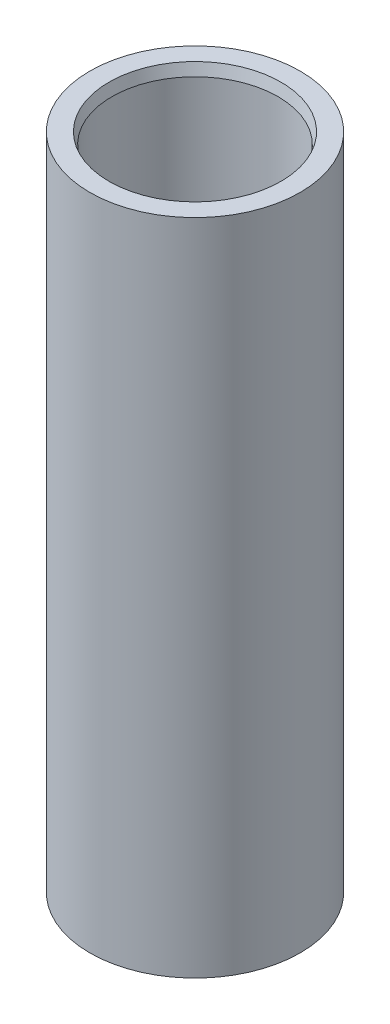
ISO-10303-21;
HEADER;
FILE_DESCRIPTION(('STEP AP214'),'2;1');
FILE_NAME('part.step','',(''),(''),'','','');
FILE_SCHEMA(('AUTOMOTIVE_DESIGN { 1 0 10303 214 1 1 1 1 }'));
ENDSEC;
DATA;
#1=APPLICATION_CONTEXT('core data for automotive mechanical design processes');
#2=APPLICATION_PROTOCOL_DEFINITION('international standard','automotive_design',2000,#1);
#3=PRODUCT_CONTEXT('',#1,'mechanical');
#4=PRODUCT('Part','Part','',(#3));
#5=PRODUCT_RELATED_PRODUCT_CATEGORY('part','',(#4));
#6=PRODUCT_DEFINITION_FORMATION('','',#4);
#7=PRODUCT_DEFINITION_CONTEXT('part definition',#1,'design');
#8=PRODUCT_DEFINITION('design','',#6,#7);
#9=PRODUCT_DEFINITION_SHAPE('','',#8);
#10=(LENGTH_UNIT() NAMED_UNIT(*) SI_UNIT(.MILLI.,.METRE.));
#11=(NAMED_UNIT(*) PLANE_ANGLE_UNIT() SI_UNIT($,.RADIAN.));
#12=(NAMED_UNIT(*) SI_UNIT($,.STERADIAN.) SOLID_ANGLE_UNIT());
#13=UNCERTAINTY_MEASURE_WITH_UNIT(LENGTH_MEASURE(1.E-05),#10,'distance_accuracy_value','');
#14=(GEOMETRIC_REPRESENTATION_CONTEXT(3) GLOBAL_UNCERTAINTY_ASSIGNED_CONTEXT((#13)) GLOBAL_UNIT_ASSIGNED_CONTEXT((#10,
#11,#12)) REPRESENTATION_CONTEXT('',''));
#15=CARTESIAN_POINT('',(0.,0.,0.));
#16=DIRECTION('',(0.,0.,1.));
#17=DIRECTION('',(1.,0.,0.));
#18=AXIS2_PLACEMENT_3D('',#15,#16,#17);
#19=CARTESIAN_POINT('',(0.,238.,0.));
#20=DIRECTION('',(0.,-1.,0.));
#21=DIRECTION('',(0.,0.,-1.));
#22=AXIS2_PLACEMENT_3D('',#19,#20,#21);
#23=CYLINDRICAL_SURFACE('',#22,38.);
#24=CARTESIAN_POINT('',(0.,238.,0.));
#25=DIRECTION('',(0.,1.,0.));
#26=DIRECTION('',(0.,0.,1.));
#27=AXIS2_PLACEMENT_3D('',#24,#25,#26);
#28=CIRCLE('',#27,38.);
#29=CARTESIAN_POINT('',(0.,238.,38.));
#30=VERTEX_POINT('',#29);
#31=EDGE_CURVE('E50',#30,#30,#28,.T.);
#32=ORIENTED_EDGE('',*,*,#31,.F.);
#33=EDGE_LOOP('',(#32));
#34=FACE_BOUND('',#33,.T.);
#35=CARTESIAN_POINT('',(0.,0.,0.));
#36=DIRECTION('',(0.,1.,0.));
#37=DIRECTION('',(0.,0.,1.));
#38=AXIS2_PLACEMENT_3D('',#35,#36,#37);
#39=CIRCLE('',#38,38.);
#40=CARTESIAN_POINT('',(0.,0.,38.));
#41=VERTEX_POINT('',#40);
#42=EDGE_CURVE('E51',#41,#41,#39,.T.);
#43=ORIENTED_EDGE('',*,*,#42,.T.);
#44=EDGE_LOOP('',(#43));
#45=FACE_BOUND('',#44,.T.);
#46=ADVANCED_FACE('F30',(#34,#45),#23,.T.);
#47=CARTESIAN_POINT('',(0.,238.,0.));
#48=DIRECTION('',(0.,1.,0.));
#49=DIRECTION('',(0.,0.,1.));
#50=AXIS2_PLACEMENT_3D('',#47,#48,#49);
#51=PLANE('',#50);
#52=CARTESIAN_POINT('',(0.,238.,0.));
#53=DIRECTION('',(0.,1.,0.));
#54=DIRECTION('',(0.,0.,1.));
#55=AXIS2_PLACEMENT_3D('',#52,#53,#54);
#56=CIRCLE('',#55,31.0717967697245);
#57=CARTESIAN_POINT('',(0.,238.,31.0717967697245));
#58=VERTEX_POINT('',#57);
#59=EDGE_CURVE('E10',#58,#58,#56,.F.);
#60=ORIENTED_EDGE('',*,*,#59,.T.);
#61=EDGE_LOOP('',(#60));
#62=FACE_BOUND('',#61,.T.);
#63=ORIENTED_EDGE('',*,*,#31,.T.);
#64=EDGE_LOOP('',(#63));
#65=FACE_BOUND('',#64,.T.);
#66=ADVANCED_FACE('F57',(#62,#65),#51,.T.);
#67=CARTESIAN_POINT('',(0.,0.,0.));
#68=DIRECTION('',(0.,1.,0.));
#69=DIRECTION('',(0.,0.,1.));
#70=AXIS2_PLACEMENT_3D('',#67,#68,#69);
#71=PLANE('',#70);
#72=CARTESIAN_POINT('',(0.,0.,0.));
#73=DIRECTION('',(0.,1.,0.));
#74=DIRECTION('',(0.,0.,1.));
#75=AXIS2_PLACEMENT_3D('',#72,#73,#74);
#76=CIRCLE('',#75,31.0717967697245);
#77=CARTESIAN_POINT('',(0.,0.,31.0717967697245));
#78=VERTEX_POINT('',#77);
#79=EDGE_CURVE('E45',#78,#78,#76,.T.);
#80=ORIENTED_EDGE('',*,*,#79,.T.);
#81=EDGE_LOOP('',(#80));
#82=FACE_BOUND('',#81,.T.);
#83=ORIENTED_EDGE('',*,*,#42,.F.);
#84=EDGE_LOOP('',(#83));
#85=FACE_BOUND('',#84,.T.);
#86=ADVANCED_FACE('F64',(#82,#85),#71,.F.);
#87=CARTESIAN_POINT('',(0.,0.,0.));
#88=DIRECTION('',(0.,1.,0.));
#89=DIRECTION('',(0.,0.,1.));
#90=AXIS2_PLACEMENT_3D('',#87,#88,#89);
#91=CYLINDRICAL_SURFACE('',#90,30.);
#92=CARTESIAN_POINT('',(0.,234.,0.));
#93=DIRECTION('',(0.,1.,0.));
#94=DIRECTION('',(0.,0.,1.));
#95=AXIS2_PLACEMENT_3D('',#92,#93,#94);
#96=CIRCLE('',#95,30.);
#97=CARTESIAN_POINT('',(0.,234.,30.));
#98=VERTEX_POINT('',#97);
#99=EDGE_CURVE('E37',#98,#98,#96,.T.);
#100=ORIENTED_EDGE('',*,*,#99,.T.);
#101=EDGE_LOOP('',(#100));
#102=FACE_BOUND('',#101,.T.);
#103=CARTESIAN_POINT('',(0.,4.00000000000006,0.));
#104=DIRECTION('',(0.,1.,0.));
#105=DIRECTION('',(0.,0.,1.));
#106=AXIS2_PLACEMENT_3D('',#103,#104,#105);
#107=CIRCLE('',#106,30.);
#108=CARTESIAN_POINT('',(0.,4.00000000000006,30.));
#109=VERTEX_POINT('',#108);
#110=EDGE_CURVE('E41',#109,#109,#107,.F.);
#111=ORIENTED_EDGE('',*,*,#110,.T.);
#112=EDGE_LOOP('',(#111));
#113=FACE_BOUND('',#112,.T.);
#114=ADVANCED_FACE('F66',(#102,#113),#91,.F.);
#115=CARTESIAN_POINT('',(0.,0.,0.));
#116=DIRECTION('',(0.,-1.,0.));
#117=DIRECTION('',(0.,0.,-1.));
#118=AXIS2_PLACEMENT_3D('',#115,#116,#117);
#119=CONICAL_SURFACE('',#118,31.0717967697245,0.261799387799146);
#120=ORIENTED_EDGE('',*,*,#110,.F.);
#121=EDGE_LOOP('',(#120));
#122=FACE_BOUND('',#121,.T.);
#123=ORIENTED_EDGE('',*,*,#79,.F.);
#124=EDGE_LOOP('',(#123));
#125=FACE_BOUND('',#124,.T.);
#126=ADVANCED_FACE('F73',(#122,#125),#119,.F.);
#127=CARTESIAN_POINT('',(0.,234.,0.));
#128=DIRECTION('',(0.,1.,0.));
#129=DIRECTION('',(0.,0.,1.));
#130=AXIS2_PLACEMENT_3D('',#127,#128,#129);
#131=CONICAL_SURFACE('',#130,30.,0.261799387799147);
#132=ORIENTED_EDGE('',*,*,#59,.F.);
#133=EDGE_LOOP('',(#132));
#134=FACE_BOUND('',#133,.T.);
#135=ORIENTED_EDGE('',*,*,#99,.F.);
#136=EDGE_LOOP('',(#135));
#137=FACE_BOUND('',#136,.T.);
#138=ADVANCED_FACE('F32',(#134,#137),#131,.F.);
#139=CLOSED_SHELL('',(#46,#66,#86,#114,#126,#138));
#140=MANIFOLD_SOLID_BREP('B2',#139);
#141=ADVANCED_BREP_SHAPE_REPRESENTATION('',(#18,#140),#14);
#142=SHAPE_DEFINITION_REPRESENTATION(#9,#141);
ENDSEC;
END-ISO-10303-21;
